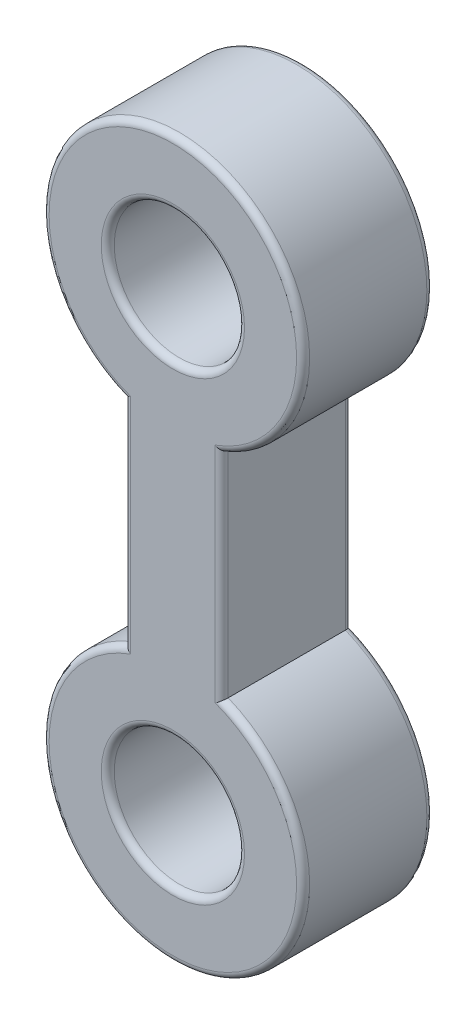
ISO-10303-21;
HEADER;
FILE_DESCRIPTION(('STEP AP214'),'2;1');
FILE_NAME('part.step','',(''),(''),'','','');
FILE_SCHEMA(('AUTOMOTIVE_DESIGN { 1 0 10303 214 1 1 1 1 }'));
ENDSEC;
DATA;
#1=APPLICATION_CONTEXT('core data for automotive mechanical design processes');
#2=APPLICATION_PROTOCOL_DEFINITION('international standard','automotive_design',2000,#1);
#3=PRODUCT_CONTEXT('',#1,'mechanical');
#4=PRODUCT('Part','Part','',(#3));
#5=PRODUCT_RELATED_PRODUCT_CATEGORY('part','',(#4));
#6=PRODUCT_DEFINITION_FORMATION('','',#4);
#7=PRODUCT_DEFINITION_CONTEXT('part definition',#1,'design');
#8=PRODUCT_DEFINITION('design','',#6,#7);
#9=PRODUCT_DEFINITION_SHAPE('','',#8);
#10=(LENGTH_UNIT() NAMED_UNIT(*) SI_UNIT(.MILLI.,.METRE.));
#11=(NAMED_UNIT(*) PLANE_ANGLE_UNIT() SI_UNIT($,.RADIAN.));
#12=(NAMED_UNIT(*) SI_UNIT($,.STERADIAN.) SOLID_ANGLE_UNIT());
#13=UNCERTAINTY_MEASURE_WITH_UNIT(LENGTH_MEASURE(1.E-05),#10,'distance_accuracy_value','');
#14=(GEOMETRIC_REPRESENTATION_CONTEXT(3) GLOBAL_UNCERTAINTY_ASSIGNED_CONTEXT((#13)) GLOBAL_UNIT_ASSIGNED_CONTEXT((#10,
#11,#12)) REPRESENTATION_CONTEXT('',''));
#15=CARTESIAN_POINT('',(0.,0.,0.));
#16=DIRECTION('',(0.,0.,1.));
#17=DIRECTION('',(1.,0.,0.));
#18=AXIS2_PLACEMENT_3D('',#15,#16,#17);
#19=CARTESIAN_POINT('',(0.,0.,10.));
#20=DIRECTION('',(0.,0.,1.));
#21=DIRECTION('',(1.,0.,0.));
#22=AXIS2_PLACEMENT_3D('',#19,#20,#21);
#23=PLANE('',#22);
#24=CARTESIAN_POINT('',(0.,-70.,10.));
#25=DIRECTION('',(0.,0.,1.));
#26=DIRECTION('',(1.,0.,0.));
#27=AXIS2_PLACEMENT_3D('',#24,#25,#26);
#28=CIRCLE('',#27,11.);
#29=CARTESIAN_POINT('',(11.,-70.,10.));
#30=VERTEX_POINT('',#29);
#31=EDGE_CURVE('E11',#30,#30,#28,.F.);
#32=ORIENTED_EDGE('',*,*,#31,.T.);
#33=EDGE_LOOP('',(#32));
#34=FACE_BOUND('',#33,.T.);
#35=CARTESIAN_POINT('',(0.,-70.,10.));
#36=DIRECTION('',(0.,0.,1.));
#37=DIRECTION('',(1.,0.,0.));
#38=AXIS2_PLACEMENT_3D('',#35,#36,#37);
#39=CIRCLE('',#38,19.);
#40=CARTESIAN_POINT('',(-6.5,-52.1464289286429,10.));
#41=VERTEX_POINT('',#40);
#42=CARTESIAN_POINT('',(6.5,-52.1464289286429,10.));
#43=VERTEX_POINT('',#42);
#44=EDGE_CURVE('E62',#41,#43,#39,.T.);
#45=ORIENTED_EDGE('',*,*,#44,.T.);
#46=DIRECTION('',(0.,1.,0.));
#47=VECTOR('',#46,1.);
#48=CARTESIAN_POINT('',(6.5,-18.5404962177392,10.));
#49=LINE('',#48,#47);
#50=CARTESIAN_POINT('',(6.5,-17.8535710713571,10.));
#51=VERTEX_POINT('',#50);
#52=EDGE_CURVE('E54',#43,#51,#49,.T.);
#53=ORIENTED_EDGE('',*,*,#52,.T.);
#54=CARTESIAN_POINT('',(0.,0.,10.));
#55=DIRECTION('',(0.,0.,1.));
#56=DIRECTION('',(1.,0.,0.));
#57=AXIS2_PLACEMENT_3D('',#54,#55,#56);
#58=CIRCLE('',#57,19.);
#59=CARTESIAN_POINT('',(-6.5,-17.8535710713571,10.));
#60=VERTEX_POINT('',#59);
#61=EDGE_CURVE('E199',#51,#60,#58,.T.);
#62=ORIENTED_EDGE('',*,*,#61,.T.);
#63=DIRECTION('',(0.,-1.,0.));
#64=VECTOR('',#63,1.);
#65=CARTESIAN_POINT('',(-6.5,-51.4595037822608,10.));
#66=LINE('',#65,#64);
#67=EDGE_CURVE('E67',#60,#41,#66,.T.);
#68=ORIENTED_EDGE('',*,*,#67,.T.);
#69=EDGE_LOOP('',(#45,#53,#62,#68));
#70=FACE_BOUND('',#69,.T.);
#71=CARTESIAN_POINT('',(0.,0.,10.));
#72=DIRECTION('',(0.,0.,1.));
#73=DIRECTION('',(1.,0.,0.));
#74=AXIS2_PLACEMENT_3D('',#71,#72,#73);
#75=CIRCLE('',#74,11.);
#76=CARTESIAN_POINT('',(11.,0.,10.));
#77=VERTEX_POINT('',#76);
#78=EDGE_CURVE('E195',#77,#77,#75,.F.);
#79=ORIENTED_EDGE('',*,*,#78,.T.);
#80=EDGE_LOOP('',(#79));
#81=FACE_BOUND('',#80,.T.);
#82=ADVANCED_FACE('F39',(#34,#70,#81),#23,.T.);
#83=CARTESIAN_POINT('',(0.,0.,-10.));
#84=DIRECTION('',(0.,0.,1.));
#85=DIRECTION('',(1.,0.,0.));
#86=AXIS2_PLACEMENT_3D('',#83,#84,#85);
#87=PLANE('',#86);
#88=CARTESIAN_POINT('',(0.,-70.,-10.));
#89=DIRECTION('',(0.,0.,1.));
#90=DIRECTION('',(1.,0.,0.));
#91=AXIS2_PLACEMENT_3D('',#88,#89,#90);
#92=CIRCLE('',#91,11.);
#93=CARTESIAN_POINT('',(11.,-70.,-10.));
#94=VERTEX_POINT('',#93);
#95=EDGE_CURVE('E147',#94,#94,#92,.T.);
#96=ORIENTED_EDGE('',*,*,#95,.T.);
#97=EDGE_LOOP('',(#96));
#98=FACE_BOUND('',#97,.T.);
#99=CARTESIAN_POINT('',(0.,0.,-10.));
#100=DIRECTION('',(0.,0.,1.));
#101=DIRECTION('',(1.,0.,0.));
#102=AXIS2_PLACEMENT_3D('',#99,#100,#101);
#103=CIRCLE('',#102,11.);
#104=CARTESIAN_POINT('',(11.,0.,-10.));
#105=VERTEX_POINT('',#104);
#106=EDGE_CURVE('E142',#105,#105,#103,.T.);
#107=ORIENTED_EDGE('',*,*,#106,.T.);
#108=EDGE_LOOP('',(#107));
#109=FACE_BOUND('',#108,.T.);
#110=CARTESIAN_POINT('',(0.,-70.,-10.));
#111=DIRECTION('',(0.,0.,1.));
#112=DIRECTION('',(1.,0.,0.));
#113=AXIS2_PLACEMENT_3D('',#110,#111,#112);
#114=CIRCLE('',#113,19.);
#115=CARTESIAN_POINT('',(6.5,-52.1464289286429,-10.));
#116=VERTEX_POINT('',#115);
#117=CARTESIAN_POINT('',(-6.5,-52.1464289286429,-10.));
#118=VERTEX_POINT('',#117);
#119=EDGE_CURVE('E140',#116,#118,#114,.F.);
#120=ORIENTED_EDGE('',*,*,#119,.T.);
#121=DIRECTION('',(0.,-1.,0.));
#122=VECTOR('',#121,1.);
#123=CARTESIAN_POINT('',(-6.5,0.,-10.));
#124=LINE('',#123,#122);
#125=CARTESIAN_POINT('',(-6.5,-17.8535710713571,-10.));
#126=VERTEX_POINT('',#125);
#127=EDGE_CURVE('E117',#118,#126,#124,.F.);
#128=ORIENTED_EDGE('',*,*,#127,.T.);
#129=CARTESIAN_POINT('',(0.,0.,-10.));
#130=DIRECTION('',(0.,0.,1.));
#131=DIRECTION('',(1.,0.,0.));
#132=AXIS2_PLACEMENT_3D('',#129,#130,#131);
#133=CIRCLE('',#132,19.);
#134=CARTESIAN_POINT('',(6.5,-17.8535710713571,-10.));
#135=VERTEX_POINT('',#134);
#136=EDGE_CURVE('E128',#126,#135,#133,.F.);
#137=ORIENTED_EDGE('',*,*,#136,.T.);
#138=DIRECTION('',(0.,1.,0.));
#139=VECTOR('',#138,1.);
#140=CARTESIAN_POINT('',(6.5,0.,-10.));
#141=LINE('',#140,#139);
#142=EDGE_CURVE('E135',#135,#116,#141,.F.);
#143=ORIENTED_EDGE('',*,*,#142,.T.);
#144=EDGE_LOOP('',(#120,#128,#137,#143));
#145=FACE_BOUND('',#144,.T.);
#146=ADVANCED_FACE('F138',(#98,#109,#145),#87,.F.);
#147=CARTESIAN_POINT('',(0.,0.,10.));
#148=DIRECTION('',(0.,0.,-1.));
#149=DIRECTION('',(-1.,0.,0.));
#150=AXIS2_PLACEMENT_3D('',#147,#148,#149);
#151=CYLINDRICAL_SURFACE('',#150,20.);
#152=DIRECTION('',(0.,0.,-1.));
#153=VECTOR('',#152,1.);
#154=CARTESIAN_POINT('',(7.5,-18.5404962177392,10.));
#155=LINE('',#154,#153);
#156=CARTESIAN_POINT('',(7.5,-18.5404962177392,9.));
#157=VERTEX_POINT('',#156);
#158=CARTESIAN_POINT('',(7.5,-18.5404962177392,-9.));
#159=VERTEX_POINT('',#158);
#160=EDGE_CURVE('E360',#157,#159,#155,.T.);
#161=ORIENTED_EDGE('',*,*,#160,.T.);
#162=CARTESIAN_POINT('',(0.,0.,-9.));
#163=DIRECTION('',(0.,0.,1.));
#164=DIRECTION('',(1.,0.,0.));
#165=AXIS2_PLACEMENT_3D('',#162,#163,#164);
#166=CIRCLE('',#165,20.);
#167=CARTESIAN_POINT('',(-7.5,-18.5404962177392,-9.));
#168=VERTEX_POINT('',#167);
#169=EDGE_CURVE('E192',#159,#168,#166,.T.);
#170=ORIENTED_EDGE('',*,*,#169,.T.);
#171=DIRECTION('',(0.,0.,-1.));
#172=VECTOR('',#171,1.);
#173=CARTESIAN_POINT('',(-7.5,-18.5404962177392,10.));
#174=LINE('',#173,#172);
#175=CARTESIAN_POINT('',(-7.5,-18.5404962177392,9.));
#176=VERTEX_POINT('',#175);
#177=EDGE_CURVE('E136',#176,#168,#174,.T.);
#178=ORIENTED_EDGE('',*,*,#177,.F.);
#179=CARTESIAN_POINT('',(0.,0.,9.));
#180=DIRECTION('',(0.,0.,1.));
#181=DIRECTION('',(1.,0.,0.));
#182=AXIS2_PLACEMENT_3D('',#179,#180,#181);
#183=CIRCLE('',#182,20.);
#184=EDGE_CURVE('E189',#176,#157,#183,.F.);
#185=ORIENTED_EDGE('',*,*,#184,.T.);
#186=EDGE_LOOP('',(#161,#170,#178,#185));
#187=FACE_BOUND('',#186,.T.);
#188=ADVANCED_FACE('F298',(#187),#151,.T.);
#189=CARTESIAN_POINT('',(-7.5,-18.5404962177392,10.));
#190=DIRECTION('',(1.,0.,0.));
#191=DIRECTION('',(0.,1.,0.));
#192=AXIS2_PLACEMENT_3D('',#189,#190,#191);
#193=PLANE('',#192);
#194=ORIENTED_EDGE('',*,*,#177,.T.);
#195=DIRECTION('',(0.,-1.,0.));
#196=VECTOR('',#195,1.);
#197=CARTESIAN_POINT('',(-7.5,-18.5404962177392,-9.));
#198=LINE('',#197,#196);
#199=CARTESIAN_POINT('',(-7.5,-51.4595037822608,-9.));
#200=VERTEX_POINT('',#199);
#201=EDGE_CURVE('E120',#168,#200,#198,.T.);
#202=ORIENTED_EDGE('',*,*,#201,.T.);
#203=DIRECTION('',(0.,0.,-1.));
#204=VECTOR('',#203,1.);
#205=CARTESIAN_POINT('',(-7.5,-51.4595037822608,10.));
#206=LINE('',#205,#204);
#207=CARTESIAN_POINT('',(-7.5,-51.4595037822608,9.));
#208=VERTEX_POINT('',#207);
#209=EDGE_CURVE('E363',#208,#200,#206,.T.);
#210=ORIENTED_EDGE('',*,*,#209,.F.);
#211=DIRECTION('',(0.,-1.,0.));
#212=VECTOR('',#211,1.);
#213=CARTESIAN_POINT('',(-7.5,-18.5404962177392,9.));
#214=LINE('',#213,#212);
#215=EDGE_CURVE('E171',#208,#176,#214,.F.);
#216=ORIENTED_EDGE('',*,*,#215,.T.);
#217=EDGE_LOOP('',(#194,#202,#210,#216));
#218=FACE_BOUND('',#217,.T.);
#219=ADVANCED_FACE('F312',(#218),#193,.F.);
#220=CARTESIAN_POINT('',(0.,-70.,10.));
#221=DIRECTION('',(0.,0.,-1.));
#222=DIRECTION('',(-1.,0.,0.));
#223=AXIS2_PLACEMENT_3D('',#220,#221,#222);
#224=CYLINDRICAL_SURFACE('',#223,20.);
#225=ORIENTED_EDGE('',*,*,#209,.T.);
#226=CARTESIAN_POINT('',(0.,-70.,-9.));
#227=DIRECTION('',(0.,0.,1.));
#228=DIRECTION('',(1.,0.,0.));
#229=AXIS2_PLACEMENT_3D('',#226,#227,#228);
#230=CIRCLE('',#229,20.);
#231=CARTESIAN_POINT('',(7.5,-51.4595037822608,-9.));
#232=VERTEX_POINT('',#231);
#233=EDGE_CURVE('E179',#200,#232,#230,.T.);
#234=ORIENTED_EDGE('',*,*,#233,.T.);
#235=DIRECTION('',(0.,0.,-1.));
#236=VECTOR('',#235,1.);
#237=CARTESIAN_POINT('',(7.5,-51.4595037822608,10.));
#238=LINE('',#237,#236);
#239=CARTESIAN_POINT('',(7.5,-51.4595037822608,9.));
#240=VERTEX_POINT('',#239);
#241=EDGE_CURVE('E357',#240,#232,#238,.T.);
#242=ORIENTED_EDGE('',*,*,#241,.F.);
#243=CARTESIAN_POINT('',(0.,-70.,9.));
#244=DIRECTION('',(0.,0.,1.));
#245=DIRECTION('',(1.,0.,0.));
#246=AXIS2_PLACEMENT_3D('',#243,#244,#245);
#247=CIRCLE('',#246,20.);
#248=EDGE_CURVE('E176',#240,#208,#247,.F.);
#249=ORIENTED_EDGE('',*,*,#248,.T.);
#250=EDGE_LOOP('',(#225,#234,#242,#249));
#251=FACE_BOUND('',#250,.T.);
#252=ADVANCED_FACE('F308',(#251),#224,.T.);
#253=CARTESIAN_POINT('',(7.5,-18.5404962177392,10.));
#254=DIRECTION('',(-1.,0.,0.));
#255=DIRECTION('',(0.,-1.,0.));
#256=AXIS2_PLACEMENT_3D('',#253,#254,#255);
#257=PLANE('',#256);
#258=ORIENTED_EDGE('',*,*,#241,.T.);
#259=DIRECTION('',(0.,1.,0.));
#260=VECTOR('',#259,1.);
#261=CARTESIAN_POINT('',(7.5,-18.5404962177392,-9.));
#262=LINE('',#261,#260);
#263=EDGE_CURVE('E186',#232,#159,#262,.T.);
#264=ORIENTED_EDGE('',*,*,#263,.T.);
#265=ORIENTED_EDGE('',*,*,#160,.F.);
#266=DIRECTION('',(0.,1.,0.));
#267=VECTOR('',#266,1.);
#268=CARTESIAN_POINT('',(7.5,-51.4595037822608,9.));
#269=LINE('',#268,#267);
#270=EDGE_CURVE('E182',#157,#240,#269,.F.);
#271=ORIENTED_EDGE('',*,*,#270,.T.);
#272=EDGE_LOOP('',(#258,#264,#265,#271));
#273=FACE_BOUND('',#272,.T.);
#274=ADVANCED_FACE('F305',(#273),#257,.F.);
#275=CARTESIAN_POINT('',(0.,0.,10.));
#276=DIRECTION('',(0.,0.,-1.));
#277=DIRECTION('',(-1.,0.,0.));
#278=AXIS2_PLACEMENT_3D('',#275,#276,#277);
#279=CYLINDRICAL_SURFACE('',#278,10.);
#280=CARTESIAN_POINT('',(0.,0.,-9.));
#281=DIRECTION('',(0.,0.,1.));
#282=DIRECTION('',(1.,0.,0.));
#283=AXIS2_PLACEMENT_3D('',#280,#281,#282);
#284=CIRCLE('',#283,10.);
#285=CARTESIAN_POINT('',(10.,0.,-9.));
#286=VERTEX_POINT('',#285);
#287=EDGE_CURVE('E167',#286,#286,#284,.F.);
#288=ORIENTED_EDGE('',*,*,#287,.T.);
#289=EDGE_LOOP('',(#288));
#290=FACE_BOUND('',#289,.T.);
#291=CARTESIAN_POINT('',(0.,0.,9.));
#292=DIRECTION('',(0.,0.,1.));
#293=DIRECTION('',(1.,0.,0.));
#294=AXIS2_PLACEMENT_3D('',#291,#292,#293);
#295=CIRCLE('',#294,10.);
#296=CARTESIAN_POINT('',(10.,0.,9.));
#297=VERTEX_POINT('',#296);
#298=EDGE_CURVE('E163',#297,#297,#295,.T.);
#299=ORIENTED_EDGE('',*,*,#298,.T.);
#300=EDGE_LOOP('',(#299));
#301=FACE_BOUND('',#300,.T.);
#302=ADVANCED_FACE('F302',(#290,#301),#279,.F.);
#303=CARTESIAN_POINT('',(0.,-70.,10.));
#304=DIRECTION('',(0.,0.,-1.));
#305=DIRECTION('',(-1.,0.,0.));
#306=AXIS2_PLACEMENT_3D('',#303,#304,#305);
#307=CYLINDRICAL_SURFACE('',#306,10.);
#308=CARTESIAN_POINT('',(0.,-70.,-9.));
#309=DIRECTION('',(0.,0.,1.));
#310=DIRECTION('',(1.,0.,0.));
#311=AXIS2_PLACEMENT_3D('',#308,#309,#310);
#312=CIRCLE('',#311,10.);
#313=CARTESIAN_POINT('',(10.,-70.,-9.));
#314=VERTEX_POINT('',#313);
#315=EDGE_CURVE('E159',#314,#314,#312,.F.);
#316=ORIENTED_EDGE('',*,*,#315,.T.);
#317=EDGE_LOOP('',(#316));
#318=FACE_BOUND('',#317,.T.);
#319=CARTESIAN_POINT('',(0.,-70.,9.));
#320=DIRECTION('',(0.,0.,1.));
#321=DIRECTION('',(1.,0.,0.));
#322=AXIS2_PLACEMENT_3D('',#319,#320,#321);
#323=CIRCLE('',#322,10.);
#324=CARTESIAN_POINT('',(10.,-70.,9.));
#325=VERTEX_POINT('',#324);
#326=EDGE_CURVE('E155',#325,#325,#323,.T.);
#327=ORIENTED_EDGE('',*,*,#326,.T.);
#328=EDGE_LOOP('',(#327));
#329=FACE_BOUND('',#328,.T.);
#330=ADVANCED_FACE('F322',(#318,#329),#307,.F.);
#331=CARTESIAN_POINT('',(0.,-70.,-9.));
#332=DIRECTION('',(0.,0.,1.));
#333=DIRECTION('',(1.,0.,0.));
#334=AXIS2_PLACEMENT_3D('',#331,#332,#333);
#335=TOROIDAL_SURFACE('',#334,11.,1.);
#336=ORIENTED_EDGE('',*,*,#315,.F.);
#337=EDGE_LOOP('',(#336));
#338=FACE_BOUND('',#337,.T.);
#339=ORIENTED_EDGE('',*,*,#95,.F.);
#340=EDGE_LOOP('',(#339));
#341=FACE_BOUND('',#340,.T.);
#342=ADVANCED_FACE('F320',(#338,#341),#335,.T.);
#343=CARTESIAN_POINT('',(0.,0.,-9.));
#344=DIRECTION('',(0.,0.,1.));
#345=DIRECTION('',(1.,0.,0.));
#346=AXIS2_PLACEMENT_3D('',#343,#344,#345);
#347=TOROIDAL_SURFACE('',#346,11.,1.);
#348=ORIENTED_EDGE('',*,*,#287,.F.);
#349=EDGE_LOOP('',(#348));
#350=FACE_BOUND('',#349,.T.);
#351=ORIENTED_EDGE('',*,*,#106,.F.);
#352=EDGE_LOOP('',(#351));
#353=FACE_BOUND('',#352,.T.);
#354=ADVANCED_FACE('F246',(#350,#353),#347,.T.);
#355=CARTESIAN_POINT('',(6.5,-18.5404962177392,-9.));
#356=DIRECTION('',(0.,1.,0.));
#357=DIRECTION('',(-1.,0.,0.));
#358=AXIS2_PLACEMENT_3D('',#355,#356,#357);
#359=CYLINDRICAL_SURFACE('',#358,1.);
#360=CARTESIAN_POINT('',(7.5,-51.4595037822608,-9.));
#361=CARTESIAN_POINT('',(7.50000189769369,-51.4595026043384,-9.02469557126901));
#362=CARTESIAN_POINT('',(7.49908446359424,-51.4601210271123,-9.04937783193884));
#363=CARTESIAN_POINT('',(7.49543833573051,-51.4625794492258,-9.09853701940789));
#364=CARTESIAN_POINT('',(7.49271038364173,-51.4644189483537,-9.12301402613303));
#365=CARTESIAN_POINT('',(7.48189376100378,-51.4717143578347,-9.19561058121729));
#366=CARTESIAN_POINT('',(7.47117157764478,-51.4789476645999,-9.24319343216988));
#367=CARTESIAN_POINT('',(7.44330371697541,-51.4977655453967,-9.33541207747412));
#368=CARTESIAN_POINT('',(7.42616581189548,-51.5093448545722,-9.38005136111824));
#369=CARTESIAN_POINT('',(7.38628330244706,-51.5363258219173,-9.46554204788778));
#370=CARTESIAN_POINT('',(7.36353264463758,-51.5517316071231,-9.50638929534488));
#371=CARTESIAN_POINT('',(7.31180630701149,-51.5868122556768,-9.58596941034456));
#372=CARTESIAN_POINT('',(7.28253378977324,-51.6066914315319,-9.62441765058433));
#373=CARTESIAN_POINT('',(7.21978477451096,-51.6493848773834,-9.69582434706756));
#374=CARTESIAN_POINT('',(7.18630749885936,-51.6721996903153,-9.72878178521296));
#375=CARTESIAN_POINT('',(7.11040415203342,-51.7240355166642,-9.79391148569648));
#376=CARTESIAN_POINT('',(7.06740673577811,-51.7534633186864,-9.82509293251835));
#377=CARTESIAN_POINT('',(6.97824901474555,-51.8146442306898,-9.87978362130724));
#378=CARTESIAN_POINT('',(6.93208430442951,-51.8464005839609,-9.90328190347743));
#379=CARTESIAN_POINT('',(6.82376706493335,-51.9211187082728,-9.94845139410932));
#380=CARTESIAN_POINT('',(6.76091166467114,-51.9646251240664,-9.96754419030609));
#381=CARTESIAN_POINT('',(6.63376141351095,-52.05296731462,-9.9931274266423));
#382=CARTESIAN_POINT('',(6.56946967618564,-52.0978002715304,-9.99964287098959));
#383=CARTESIAN_POINT('',(6.50356311398427,-52.1439343793164,-9.99999524228929));
#384=CARTESIAN_POINT('',(6.50178148239447,-52.1451816401532,-10.0000000029543));
#385=CARTESIAN_POINT('',(6.5,-52.1464289286429,-10.));
#386=B_SPLINE_CURVE_WITH_KNOTS('',3,(#360,#361,#362,#363,#364,#365,#366,#367,#368,#369,#370,
#371,#372,#373,#374,#375,#376,#377,#378,#379,#380,#381,#382,#383,#384,#385),.UNSPECIFIED.,.F.,
.F.,(4,2,2,2,2,2,2,2,2,2,2,2,4),(0.,0.0740361905573394,0.148042071024502,0.295173080104486,
0.44212642329059,0.589238956169166,0.745400938242293,0.901591843537982,1.08306771193246,
1.26480133198613,1.50008249081373,1.73489541893545,1.74141988969473),.UNSPECIFIED.);
#387=EDGE_CURVE('E124',#116,#232,#386,.F.);
#388=ORIENTED_EDGE('',*,*,#387,.F.);
#389=ORIENTED_EDGE('',*,*,#142,.F.);
#390=CARTESIAN_POINT('',(7.5,-18.5404962177392,-9.));
#391=CARTESIAN_POINT('',(7.5000018976937,-18.5404973956616,-9.02469557126901));
#392=CARTESIAN_POINT('',(7.49908446359424,-18.5398789728877,-9.04937783193884));
#393=CARTESIAN_POINT('',(7.49543833573051,-18.5374205507742,-9.09853701940789));
#394=CARTESIAN_POINT('',(7.49271038364173,-18.5355810516463,-9.12301402613303));
#395=CARTESIAN_POINT('',(7.48189376100378,-18.5282856421653,-9.19561058121729));
#396=CARTESIAN_POINT('',(7.47117157764478,-18.5210523354001,-9.24319343216988));
#397=CARTESIAN_POINT('',(7.44330371697541,-18.5022344546033,-9.33541207747412));
#398=CARTESIAN_POINT('',(7.42616581189548,-18.4906551454278,-9.38005136111824));
#399=CARTESIAN_POINT('',(7.38628330244706,-18.4636741780827,-9.46554204788778));
#400=CARTESIAN_POINT('',(7.36353264463758,-18.4482683928769,-9.50638929534488));
#401=CARTESIAN_POINT('',(7.31180630701149,-18.4131877443232,-9.58596941034456));
#402=CARTESIAN_POINT('',(7.28253378977325,-18.3933085684681,-9.62441765058433));
#403=CARTESIAN_POINT('',(7.21978477451096,-18.3506151226166,-9.69582434706756));
#404=CARTESIAN_POINT('',(7.18630749885936,-18.3278003096847,-9.72878178521296));
#405=CARTESIAN_POINT('',(7.11040415203342,-18.2759644833358,-9.79391148569648));
#406=CARTESIAN_POINT('',(7.06740673577811,-18.2465366813136,-9.82509293251835));
#407=CARTESIAN_POINT('',(6.97824901474555,-18.1853557693102,-9.87978362130725));
#408=CARTESIAN_POINT('',(6.93208430442951,-18.1535994160391,-9.90328190347744));
#409=CARTESIAN_POINT('',(6.82376706493334,-18.0788812917272,-9.94845139410933));
#410=CARTESIAN_POINT('',(6.76091166467112,-18.0353748759336,-9.96754419030609));
#411=CARTESIAN_POINT('',(6.63376141351097,-17.94703268538,-9.9931274266423));
#412=CARTESIAN_POINT('',(6.56946967618573,-17.9021997284694,-9.99964287098959));
#413=CARTESIAN_POINT('',(6.50356311398428,-17.8560656206836,-9.99999524228929));
#414=CARTESIAN_POINT('',(6.50178148239448,-17.8548183598468,-10.0000000029543));
#415=CARTESIAN_POINT('',(6.5,-17.8535710713571,-10.));
#416=B_SPLINE_CURVE_WITH_KNOTS('',3,(#390,#391,#392,#393,#394,#395,#396,#397,#398,#399,#400,
#401,#402,#403,#404,#405,#406,#407,#408,#409,#410,#411,#412,#413,#414,#415),.UNSPECIFIED.,.F.,
.F.,(4,2,2,2,2,2,2,2,2,2,2,2,4),(0.,0.0740361905573394,0.148042071024502,0.295173080104486,
0.442126423290588,0.589238956169167,0.745400938242296,0.901591843537985,1.08306771193246,
1.26480133198613,1.50008249081373,1.73489541893545,1.74141988969473),.UNSPECIFIED.);
#417=EDGE_CURVE('E131',#159,#135,#416,.T.);
#418=ORIENTED_EDGE('',*,*,#417,.F.);
#419=ORIENTED_EDGE('',*,*,#263,.F.);
#420=EDGE_LOOP('',(#388,#389,#418,#419));
#421=FACE_BOUND('',#420,.T.);
#422=ADVANCED_FACE('F242',(#421),#359,.T.);
#423=CARTESIAN_POINT('',(0.,0.,-9.));
#424=DIRECTION('',(0.,0.,1.));
#425=DIRECTION('',(1.,0.,0.));
#426=AXIS2_PLACEMENT_3D('',#423,#424,#425);
#427=TOROIDAL_SURFACE('',#426,19.,1.);
#428=ORIENTED_EDGE('',*,*,#417,.T.);
#429=ORIENTED_EDGE('',*,*,#136,.F.);
#430=CARTESIAN_POINT('',(-7.5,-18.5404962177392,-9.));
#431=CARTESIAN_POINT('',(-7.5000018976937,-18.5404973956616,-9.02469557126901));
#432=CARTESIAN_POINT('',(-7.49908446359424,-18.5398789728877,-9.04937783193884));
#433=CARTESIAN_POINT('',(-7.49543833573051,-18.5374205507742,-9.09853701940789));
#434=CARTESIAN_POINT('',(-7.49271038364173,-18.5355810516463,-9.12301402613303));
#435=CARTESIAN_POINT('',(-7.48189376100378,-18.5282856421653,-9.19561058121729));
#436=CARTESIAN_POINT('',(-7.47117157764478,-18.5210523354001,-9.24319343216988));
#437=CARTESIAN_POINT('',(-7.44330371697541,-18.5022344546033,-9.33541207747412));
#438=CARTESIAN_POINT('',(-7.42616581189548,-18.4906551454278,-9.38005136111824));
#439=CARTESIAN_POINT('',(-7.38628330244706,-18.4636741780827,-9.46554204788778));
#440=CARTESIAN_POINT('',(-7.36353264463758,-18.4482683928769,-9.50638929534488));
#441=CARTESIAN_POINT('',(-7.31180630701149,-18.4131877443232,-9.58596941034456));
#442=CARTESIAN_POINT('',(-7.28253378977325,-18.3933085684681,-9.62441765058433));
#443=CARTESIAN_POINT('',(-7.21978477451096,-18.3506151226166,-9.69582434706756));
#444=CARTESIAN_POINT('',(-7.18630749885936,-18.3278003096847,-9.72878178521296));
#445=CARTESIAN_POINT('',(-7.11040415203342,-18.2759644833358,-9.79391148569648));
#446=CARTESIAN_POINT('',(-7.06740673577811,-18.2465366813136,-9.82509293251835));
#447=CARTESIAN_POINT('',(-6.97824901474555,-18.1853557693102,-9.87978362130725));
#448=CARTESIAN_POINT('',(-6.93208430442951,-18.1535994160391,-9.90328190347744));
#449=CARTESIAN_POINT('',(-6.82376706493334,-18.0788812917272,-9.94845139410933));
#450=CARTESIAN_POINT('',(-6.76091166467112,-18.0353748759336,-9.96754419030609));
#451=CARTESIAN_POINT('',(-6.63376141351097,-17.94703268538,-9.9931274266423));
#452=CARTESIAN_POINT('',(-6.56946967618573,-17.9021997284694,-9.99964287098959));
#453=CARTESIAN_POINT('',(-6.50356311398428,-17.8560656206836,-9.99999524228929));
#454=CARTESIAN_POINT('',(-6.50178148239448,-17.8548183598468,-10.0000000029543));
#455=CARTESIAN_POINT('',(-6.5,-17.8535710713571,-10.));
#456=B_SPLINE_CURVE_WITH_KNOTS('',3,(#430,#431,#432,#433,#434,#435,#436,#437,#438,#439,#440,
#441,#442,#443,#444,#445,#446,#447,#448,#449,#450,#451,#452,#453,#454,#455),.UNSPECIFIED.,.F.,
.F.,(4,2,2,2,2,2,2,2,2,2,2,2,4),(0.,0.0740361905573394,0.148042071024502,0.295173080104486,
0.442126423290588,0.589238956169167,0.745400938242296,0.901591843537985,1.08306771193246,
1.26480133198613,1.50008249081373,1.73489541893545,1.74141988969473),.UNSPECIFIED.);
#457=EDGE_CURVE('E113',#168,#126,#456,.T.);
#458=ORIENTED_EDGE('',*,*,#457,.F.);
#459=ORIENTED_EDGE('',*,*,#169,.F.);
#460=EDGE_LOOP('',(#428,#429,#458,#459));
#461=FACE_BOUND('',#460,.T.);
#462=ADVANCED_FACE('F129',(#461),#427,.T.);
#463=CARTESIAN_POINT('',(0.,-70.,-9.));
#464=DIRECTION('',(0.,0.,1.));
#465=DIRECTION('',(1.,0.,0.));
#466=AXIS2_PLACEMENT_3D('',#463,#464,#465);
#467=TOROIDAL_SURFACE('',#466,19.,1.);
#468=ORIENTED_EDGE('',*,*,#387,.T.);
#469=ORIENTED_EDGE('',*,*,#233,.F.);
#470=CARTESIAN_POINT('',(-7.5,-51.4595037822608,-9.));
#471=CARTESIAN_POINT('',(-7.50000189769369,-51.4595026043384,-9.02469557126901));
#472=CARTESIAN_POINT('',(-7.49908446359424,-51.4601210271123,-9.04937783193884));
#473=CARTESIAN_POINT('',(-7.49543833573051,-51.4625794492258,-9.09853701940789));
#474=CARTESIAN_POINT('',(-7.49271038364173,-51.4644189483537,-9.12301402613303));
#475=CARTESIAN_POINT('',(-7.48189376100378,-51.4717143578347,-9.19561058121729));
#476=CARTESIAN_POINT('',(-7.47117157764478,-51.4789476645999,-9.24319343216988));
#477=CARTESIAN_POINT('',(-7.44330371697541,-51.4977655453967,-9.33541207747412));
#478=CARTESIAN_POINT('',(-7.42616581189548,-51.5093448545722,-9.38005136111824));
#479=CARTESIAN_POINT('',(-7.38628330244706,-51.5363258219173,-9.46554204788778));
#480=CARTESIAN_POINT('',(-7.36353264463758,-51.5517316071231,-9.50638929534488));
#481=CARTESIAN_POINT('',(-7.31180630701149,-51.5868122556768,-9.58596941034456));
#482=CARTESIAN_POINT('',(-7.28253378977324,-51.6066914315319,-9.62441765058433));
#483=CARTESIAN_POINT('',(-7.21978477451096,-51.6493848773834,-9.69582434706756));
#484=CARTESIAN_POINT('',(-7.18630749885936,-51.6721996903153,-9.72878178521296));
#485=CARTESIAN_POINT('',(-7.11040415203342,-51.7240355166642,-9.79391148569647));
#486=CARTESIAN_POINT('',(-7.06740673577811,-51.7534633186864,-9.82509293251835));
#487=CARTESIAN_POINT('',(-6.97824901474555,-51.8146442306898,-9.87978362130724));
#488=CARTESIAN_POINT('',(-6.93208430442951,-51.8464005839609,-9.90328190347743));
#489=CARTESIAN_POINT('',(-6.82376706493335,-51.9211187082728,-9.94845139410932));
#490=CARTESIAN_POINT('',(-6.76091166467114,-51.9646251240664,-9.96754419030609));
#491=CARTESIAN_POINT('',(-6.63376141351095,-52.05296731462,-9.9931274266423));
#492=CARTESIAN_POINT('',(-6.56946967618564,-52.0978002715304,-9.99964287098959));
#493=CARTESIAN_POINT('',(-6.50356311398427,-52.1439343793164,-9.99999524228929));
#494=CARTESIAN_POINT('',(-6.50178148239447,-52.1451816401532,-10.0000000029543));
#495=CARTESIAN_POINT('',(-6.5,-52.1464289286429,-10.));
#496=B_SPLINE_CURVE_WITH_KNOTS('',3,(#470,#471,#472,#473,#474,#475,#476,#477,#478,#479,#480,
#481,#482,#483,#484,#485,#486,#487,#488,#489,#490,#491,#492,#493,#494,#495),.UNSPECIFIED.,.F.,
.F.,(4,2,2,2,2,2,2,2,2,2,2,2,4),(0.,0.0740361905573393,0.148042071024502,0.295173080104486,
0.44212642329059,0.589238956169166,0.745400938242293,0.901591843537982,1.08306771193245,
1.26480133198613,1.50008249081373,1.73489541893545,1.74141988969473),.UNSPECIFIED.);
#497=EDGE_CURVE('E125',#118,#200,#496,.F.);
#498=ORIENTED_EDGE('',*,*,#497,.F.);
#499=ORIENTED_EDGE('',*,*,#119,.F.);
#500=EDGE_LOOP('',(#468,#469,#498,#499));
#501=FACE_BOUND('',#500,.T.);
#502=ADVANCED_FACE('F223',(#501),#467,.T.);
#503=CARTESIAN_POINT('',(-6.5,-18.5404962177392,-9.));
#504=DIRECTION('',(0.,-1.,0.));
#505=DIRECTION('',(1.,0.,0.));
#506=AXIS2_PLACEMENT_3D('',#503,#504,#505);
#507=CYLINDRICAL_SURFACE('',#506,1.);
#508=ORIENTED_EDGE('',*,*,#457,.T.);
#509=ORIENTED_EDGE('',*,*,#127,.F.);
#510=ORIENTED_EDGE('',*,*,#497,.T.);
#511=ORIENTED_EDGE('',*,*,#201,.F.);
#512=EDGE_LOOP('',(#508,#509,#510,#511));
#513=FACE_BOUND('',#512,.T.);
#514=ADVANCED_FACE('F115',(#513),#507,.T.);
#515=CARTESIAN_POINT('',(0.,-70.,9.));
#516=DIRECTION('',(0.,0.,1.));
#517=DIRECTION('',(1.,0.,0.));
#518=AXIS2_PLACEMENT_3D('',#515,#516,#517);
#519=TOROIDAL_SURFACE('',#518,11.,1.);
#520=ORIENTED_EDGE('',*,*,#31,.F.);
#521=EDGE_LOOP('',(#520));
#522=FACE_BOUND('',#521,.T.);
#523=ORIENTED_EDGE('',*,*,#326,.F.);
#524=EDGE_LOOP('',(#523));
#525=FACE_BOUND('',#524,.T.);
#526=ADVANCED_FACE('F248',(#522,#525),#519,.T.);
#527=CARTESIAN_POINT('',(-6.5,0.,9.));
#528=DIRECTION('',(0.,1.,0.));
#529=DIRECTION('',(-1.,0.,0.));
#530=AXIS2_PLACEMENT_3D('',#527,#528,#529);
#531=CYLINDRICAL_SURFACE('',#530,1.);
#532=CARTESIAN_POINT('',(-7.5,-18.5404962177392,9.));
#533=CARTESIAN_POINT('',(-7.5000018976937,-18.5404973956616,9.02469557126901));
#534=CARTESIAN_POINT('',(-7.49908446359424,-18.5398789728877,9.04937783193884));
#535=CARTESIAN_POINT('',(-7.49543833573051,-18.5374205507742,9.09853701940789));
#536=CARTESIAN_POINT('',(-7.49271038364173,-18.5355810516463,9.12301402613303));
#537=CARTESIAN_POINT('',(-7.48189376100378,-18.5282856421653,9.19561058121729));
#538=CARTESIAN_POINT('',(-7.47117157764478,-18.5210523354001,9.24319343216988));
#539=CARTESIAN_POINT('',(-7.44330371697541,-18.5022344546033,9.33541207747411));
#540=CARTESIAN_POINT('',(-7.42616581189548,-18.4906551454278,9.38005136111823));
#541=CARTESIAN_POINT('',(-7.38628330244706,-18.4636741780827,9.46554204788778));
#542=CARTESIAN_POINT('',(-7.36353264463758,-18.4482683928769,9.50638929534488));
#543=CARTESIAN_POINT('',(-7.31180630701149,-18.4131877443232,9.58596941034455));
#544=CARTESIAN_POINT('',(-7.28253378977325,-18.3933085684681,9.62441765058433));
#545=CARTESIAN_POINT('',(-7.21978477451096,-18.3506151226166,9.69582434706756));
#546=CARTESIAN_POINT('',(-7.18630749885936,-18.3278003096847,9.72878178521296));
#547=CARTESIAN_POINT('',(-7.11040415203342,-18.2759644833358,9.79391148569647));
#548=CARTESIAN_POINT('',(-7.06740673577811,-18.2465366813136,9.82509293251835));
#549=CARTESIAN_POINT('',(-6.97824901474555,-18.1853557693102,9.87978362130725));
#550=CARTESIAN_POINT('',(-6.93208430442951,-18.1535994160391,9.90328190347743));
#551=CARTESIAN_POINT('',(-6.82376706493334,-18.0788812917272,9.94845139410932));
#552=CARTESIAN_POINT('',(-6.76091166467112,-18.0353748759336,9.96754419030609));
#553=CARTESIAN_POINT('',(-6.63376141351097,-17.94703268538,9.9931274266423));
#554=CARTESIAN_POINT('',(-6.56946967618573,-17.9021997284694,9.99964287098958));
#555=CARTESIAN_POINT('',(-6.50356311398428,-17.8560656206836,9.99999524228929));
#556=CARTESIAN_POINT('',(-6.50178148239448,-17.8548183598468,10.0000000029543));
#557=CARTESIAN_POINT('',(-6.5,-17.8535710713571,10.));
#558=B_SPLINE_CURVE_WITH_KNOTS('',3,(#532,#533,#534,#535,#536,#537,#538,#539,#540,#541,#542,
#543,#544,#545,#546,#547,#548,#549,#550,#551,#552,#553,#554,#555,#556,#557),.UNSPECIFIED.,.F.,
.F.,(4,2,2,2,2,2,2,2,2,2,2,2,4),(0.,0.0740361905573394,0.148042071024502,0.295173080104486,
0.442126423290588,0.589238956169167,0.745400938242296,0.901591843537985,1.08306771193246,
1.26480133198613,1.50008249081373,1.73489541893545,1.74141988969473),.UNSPECIFIED.);
#559=EDGE_CURVE('E269',#176,#60,#558,.T.);
#560=ORIENTED_EDGE('',*,*,#559,.F.);
#561=ORIENTED_EDGE('',*,*,#215,.F.);
#562=CARTESIAN_POINT('',(-7.5,-51.4595037822608,9.));
#563=CARTESIAN_POINT('',(-7.50000189769369,-51.4595026043384,9.02469557126901));
#564=CARTESIAN_POINT('',(-7.49908446359424,-51.4601210271123,9.04937783193884));
#565=CARTESIAN_POINT('',(-7.49543833573051,-51.4625794492258,9.09853701940789));
#566=CARTESIAN_POINT('',(-7.49271038364173,-51.4644189483537,9.12301402613303));
#567=CARTESIAN_POINT('',(-7.48189376100378,-51.4717143578347,9.19561058121729));
#568=CARTESIAN_POINT('',(-7.47117157764478,-51.4789476645999,9.24319343216988));
#569=CARTESIAN_POINT('',(-7.44330371697541,-51.4977655453967,9.33541207747411));
#570=CARTESIAN_POINT('',(-7.42616581189548,-51.5093448545722,9.38005136111823));
#571=CARTESIAN_POINT('',(-7.38628330244706,-51.5363258219173,9.46554204788778));
#572=CARTESIAN_POINT('',(-7.36353264463758,-51.5517316071231,9.50638929534488));
#573=CARTESIAN_POINT('',(-7.31180630701149,-51.5868122556768,9.58596941034455));
#574=CARTESIAN_POINT('',(-7.28253378977324,-51.6066914315319,9.62441765058433));
#575=CARTESIAN_POINT('',(-7.21978477451096,-51.6493848773834,9.69582434706756));
#576=CARTESIAN_POINT('',(-7.18630749885936,-51.6721996903153,9.72878178521295));
#577=CARTESIAN_POINT('',(-7.11040415203342,-51.7240355166642,9.79391148569647));
#578=CARTESIAN_POINT('',(-7.06740673577811,-51.7534633186864,9.82509293251835));
#579=CARTESIAN_POINT('',(-6.97824901474555,-51.8146442306898,9.87978362130724));
#580=CARTESIAN_POINT('',(-6.93208430442951,-51.8464005839609,9.90328190347743));
#581=CARTESIAN_POINT('',(-6.82376706493335,-51.9211187082728,9.94845139410932));
#582=CARTESIAN_POINT('',(-6.76091166467114,-51.9646251240664,9.96754419030609));
#583=CARTESIAN_POINT('',(-6.63376141351094,-52.05296731462,9.9931274266423));
#584=CARTESIAN_POINT('',(-6.56946967618562,-52.0978002715304,9.99964287098958));
#585=CARTESIAN_POINT('',(-6.50356311398427,-52.1439343793164,9.99999524228929));
#586=CARTESIAN_POINT('',(-6.50178148239447,-52.1451816401532,10.0000000029543));
#587=CARTESIAN_POINT('',(-6.5,-52.1464289286429,10.));
#588=B_SPLINE_CURVE_WITH_KNOTS('',3,(#562,#563,#564,#565,#566,#567,#568,#569,#570,#571,#572,
#573,#574,#575,#576,#577,#578,#579,#580,#581,#582,#583,#584,#585,#586,#587),.UNSPECIFIED.,.F.,
.F.,(4,2,2,2,2,2,2,2,2,2,2,2,4),(0.,0.0740361905573393,0.148042071024502,0.295173080104486,
0.442126423290588,0.589238956169166,0.745400938242293,0.901591843537982,1.08306771193246,
1.26480133198613,1.50008249081373,1.73489541893546,1.74141988969473),.UNSPECIFIED.);
#589=EDGE_CURVE('E43',#41,#208,#588,.F.);
#590=ORIENTED_EDGE('',*,*,#589,.F.);
#591=ORIENTED_EDGE('',*,*,#67,.F.);
#592=EDGE_LOOP('',(#560,#561,#590,#591));
#593=FACE_BOUND('',#592,.T.);
#594=ADVANCED_FACE('F252',(#593),#531,.T.);
#595=CARTESIAN_POINT('',(0.,-70.,9.));
#596=DIRECTION('',(0.,0.,1.));
#597=DIRECTION('',(1.,0.,0.));
#598=AXIS2_PLACEMENT_3D('',#595,#596,#597);
#599=TOROIDAL_SURFACE('',#598,19.,1.);
#600=ORIENTED_EDGE('',*,*,#589,.T.);
#601=ORIENTED_EDGE('',*,*,#248,.F.);
#602=CARTESIAN_POINT('',(7.5,-51.4595037822608,9.));
#603=CARTESIAN_POINT('',(7.50000189769369,-51.4595026043384,9.02469557126901));
#604=CARTESIAN_POINT('',(7.49908446359424,-51.4601210271123,9.04937783193884));
#605=CARTESIAN_POINT('',(7.49543833573051,-51.4625794492258,9.09853701940789));
#606=CARTESIAN_POINT('',(7.49271038364173,-51.4644189483537,9.12301402613303));
#607=CARTESIAN_POINT('',(7.48189376100378,-51.4717143578347,9.19561058121729));
#608=CARTESIAN_POINT('',(7.47117157764478,-51.4789476645999,9.24319343216988));
#609=CARTESIAN_POINT('',(7.44330371697541,-51.4977655453967,9.33541207747411));
#610=CARTESIAN_POINT('',(7.42616581189548,-51.5093448545722,9.38005136111823));
#611=CARTESIAN_POINT('',(7.38628330244706,-51.5363258219173,9.46554204788778));
#612=CARTESIAN_POINT('',(7.36353264463758,-51.5517316071231,9.50638929534488));
#613=CARTESIAN_POINT('',(7.31180630701149,-51.5868122556768,9.58596941034455));
#614=CARTESIAN_POINT('',(7.28253378977324,-51.6066914315319,9.62441765058433));
#615=CARTESIAN_POINT('',(7.21978477451096,-51.6493848773834,9.69582434706756));
#616=CARTESIAN_POINT('',(7.18630749885936,-51.6721996903153,9.72878178521295));
#617=CARTESIAN_POINT('',(7.11040415203342,-51.7240355166642,9.79391148569647));
#618=CARTESIAN_POINT('',(7.06740673577811,-51.7534633186864,9.82509293251835));
#619=CARTESIAN_POINT('',(6.97824901474555,-51.8146442306898,9.87978362130724));
#620=CARTESIAN_POINT('',(6.93208430442951,-51.8464005839609,9.90328190347743));
#621=CARTESIAN_POINT('',(6.82376706493335,-51.9211187082728,9.94845139410932));
#622=CARTESIAN_POINT('',(6.76091166467114,-51.9646251240664,9.96754419030609));
#623=CARTESIAN_POINT('',(6.63376141351094,-52.05296731462,9.9931274266423));
#624=CARTESIAN_POINT('',(6.56946967618562,-52.0978002715304,9.99964287098958));
#625=CARTESIAN_POINT('',(6.50356311398427,-52.1439343793164,9.99999524228929));
#626=CARTESIAN_POINT('',(6.50178148239447,-52.1451816401532,10.0000000029543));
#627=CARTESIAN_POINT('',(6.5,-52.1464289286429,10.));
#628=B_SPLINE_CURVE_WITH_KNOTS('',3,(#602,#603,#604,#605,#606,#607,#608,#609,#610,#611,#612,
#613,#614,#615,#616,#617,#618,#619,#620,#621,#622,#623,#624,#625,#626,#627),.UNSPECIFIED.,.F.,
.F.,(4,2,2,2,2,2,2,2,2,2,2,2,4),(0.,0.0740361905573394,0.148042071024502,0.295173080104486,
0.442126423290589,0.589238956169166,0.745400938242293,0.901591843537982,1.08306771193245,
1.26480133198613,1.50008249081373,1.73489541893546,1.74141988969473),.UNSPECIFIED.);
#629=EDGE_CURVE('E276',#43,#240,#628,.F.);
#630=ORIENTED_EDGE('',*,*,#629,.F.);
#631=ORIENTED_EDGE('',*,*,#44,.F.);
#632=EDGE_LOOP('',(#600,#601,#630,#631));
#633=FACE_BOUND('',#632,.T.);
#634=ADVANCED_FACE('F259',(#633),#599,.T.);
#635=CARTESIAN_POINT('',(0.,0.,9.));
#636=DIRECTION('',(0.,0.,1.));
#637=DIRECTION('',(1.,0.,0.));
#638=AXIS2_PLACEMENT_3D('',#635,#636,#637);
#639=TOROIDAL_SURFACE('',#638,19.,1.);
#640=ORIENTED_EDGE('',*,*,#559,.T.);
#641=ORIENTED_EDGE('',*,*,#61,.F.);
#642=CARTESIAN_POINT('',(7.5,-18.5404962177392,9.));
#643=CARTESIAN_POINT('',(7.5000018976937,-18.5404973956616,9.02469557126901));
#644=CARTESIAN_POINT('',(7.49908446359424,-18.5398789728877,9.04937783193884));
#645=CARTESIAN_POINT('',(7.49543833573051,-18.5374205507742,9.09853701940789));
#646=CARTESIAN_POINT('',(7.49271038364173,-18.5355810516463,9.12301402613303));
#647=CARTESIAN_POINT('',(7.48189376100378,-18.5282856421653,9.19561058121729));
#648=CARTESIAN_POINT('',(7.47117157764478,-18.5210523354001,9.24319343216988));
#649=CARTESIAN_POINT('',(7.44330371697541,-18.5022344546033,9.33541207747411));
#650=CARTESIAN_POINT('',(7.42616581189548,-18.4906551454278,9.38005136111823));
#651=CARTESIAN_POINT('',(7.38628330244706,-18.4636741780827,9.46554204788778));
#652=CARTESIAN_POINT('',(7.36353264463758,-18.4482683928769,9.50638929534488));
#653=CARTESIAN_POINT('',(7.31180630701149,-18.4131877443232,9.58596941034455));
#654=CARTESIAN_POINT('',(7.28253378977325,-18.3933085684681,9.62441765058433));
#655=CARTESIAN_POINT('',(7.21978477451096,-18.3506151226166,9.69582434706756));
#656=CARTESIAN_POINT('',(7.18630749885936,-18.3278003096847,9.72878178521296));
#657=CARTESIAN_POINT('',(7.11040415203342,-18.2759644833358,9.79391148569647));
#658=CARTESIAN_POINT('',(7.06740673577811,-18.2465366813136,9.82509293251835));
#659=CARTESIAN_POINT('',(6.97824901474555,-18.1853557693102,9.87978362130725));
#660=CARTESIAN_POINT('',(6.93208430442951,-18.1535994160391,9.90328190347743));
#661=CARTESIAN_POINT('',(6.82376706493334,-18.0788812917272,9.94845139410932));
#662=CARTESIAN_POINT('',(6.76091166467112,-18.0353748759336,9.96754419030609));
#663=CARTESIAN_POINT('',(6.63376141351097,-17.94703268538,9.9931274266423));
#664=CARTESIAN_POINT('',(6.56946967618573,-17.9021997284694,9.99964287098958));
#665=CARTESIAN_POINT('',(6.50356311398428,-17.8560656206836,9.99999524228929));
#666=CARTESIAN_POINT('',(6.50178148239448,-17.8548183598468,10.0000000029543));
#667=CARTESIAN_POINT('',(6.5,-17.8535710713571,10.));
#668=B_SPLINE_CURVE_WITH_KNOTS('',3,(#642,#643,#644,#645,#646,#647,#648,#649,#650,#651,#652,
#653,#654,#655,#656,#657,#658,#659,#660,#661,#662,#663,#664,#665,#666,#667),.UNSPECIFIED.,.F.,
.F.,(4,2,2,2,2,2,2,2,2,2,2,2,4),(0.,0.0740361905573394,0.148042071024502,0.295173080104486,
0.442126423290588,0.589238956169167,0.745400938242296,0.901591843537985,1.08306771193246,
1.26480133198613,1.50008249081373,1.73489541893545,1.74141988969473),.UNSPECIFIED.);
#669=EDGE_CURVE('E263',#157,#51,#668,.T.);
#670=ORIENTED_EDGE('',*,*,#669,.F.);
#671=ORIENTED_EDGE('',*,*,#184,.F.);
#672=EDGE_LOOP('',(#640,#641,#670,#671));
#673=FACE_BOUND('',#672,.T.);
#674=ADVANCED_FACE('F254',(#673),#639,.T.);
#675=CARTESIAN_POINT('',(6.5,0.,9.));
#676=DIRECTION('',(0.,-1.,0.));
#677=DIRECTION('',(1.,0.,0.));
#678=AXIS2_PLACEMENT_3D('',#675,#676,#677);
#679=CYLINDRICAL_SURFACE('',#678,1.);
#680=ORIENTED_EDGE('',*,*,#629,.T.);
#681=ORIENTED_EDGE('',*,*,#270,.F.);
#682=ORIENTED_EDGE('',*,*,#669,.T.);
#683=ORIENTED_EDGE('',*,*,#52,.F.);
#684=EDGE_LOOP('',(#680,#681,#682,#683));
#685=FACE_BOUND('',#684,.T.);
#686=ADVANCED_FACE('F258',(#685),#679,.T.);
#687=CARTESIAN_POINT('',(0.,0.,9.));
#688=DIRECTION('',(0.,0.,1.));
#689=DIRECTION('',(1.,0.,0.));
#690=AXIS2_PLACEMENT_3D('',#687,#688,#689);
#691=TOROIDAL_SURFACE('',#690,11.,1.);
#692=ORIENTED_EDGE('',*,*,#78,.F.);
#693=EDGE_LOOP('',(#692));
#694=FACE_BOUND('',#693,.T.);
#695=ORIENTED_EDGE('',*,*,#298,.F.);
#696=EDGE_LOOP('',(#695));
#697=FACE_BOUND('',#696,.T.);
#698=ADVANCED_FACE('F41',(#694,#697),#691,.T.);
#699=CLOSED_SHELL('',(#82,#146,#188,#219,#252,#274,#302,#330,#342,#354,#422,#462,#502,#514,#526,
#594,#634,#674,#686,#698));
#700=MANIFOLD_SOLID_BREP('B2',#699);
#701=ADVANCED_BREP_SHAPE_REPRESENTATION('',(#18,#700),#14);
#702=SHAPE_DEFINITION_REPRESENTATION(#9,#701);
ENDSEC;
END-ISO-10303-21;
